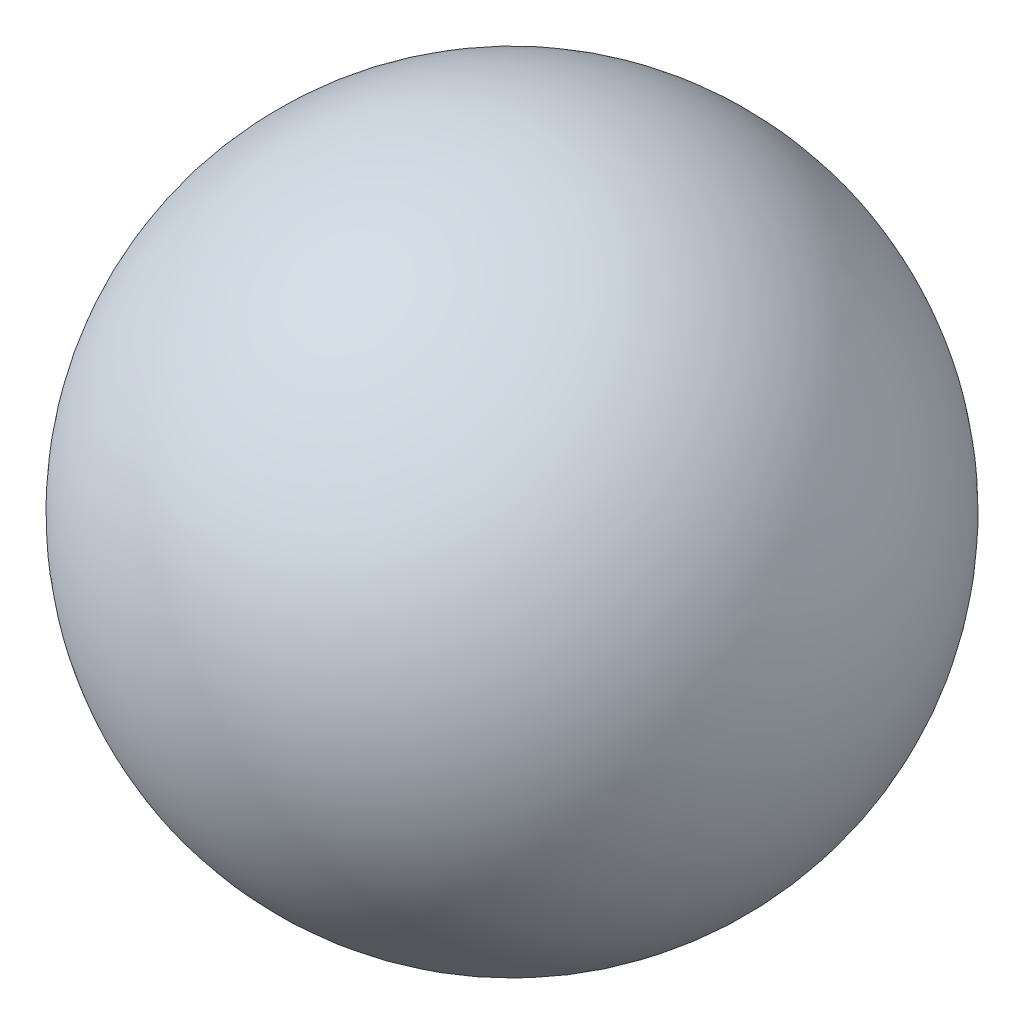
ISO-10303-21;
HEADER;
FILE_DESCRIPTION(('STEP AP214'),'2;1');
FILE_NAME('part.step','',(''),(''),'','','');
FILE_SCHEMA(('AUTOMOTIVE_DESIGN { 1 0 10303 214 1 1 1 1 }'));
ENDSEC;
DATA;
#1=APPLICATION_CONTEXT('core data for automotive mechanical design processes');
#2=APPLICATION_PROTOCOL_DEFINITION('international standard','automotive_design',2000,#1);
#3=PRODUCT_CONTEXT('',#1,'mechanical');
#4=PRODUCT('Part','Part','',(#3));
#5=PRODUCT_RELATED_PRODUCT_CATEGORY('part','',(#4));
#6=PRODUCT_DEFINITION_FORMATION('','',#4);
#7=PRODUCT_DEFINITION_CONTEXT('part definition',#1,'design');
#8=PRODUCT_DEFINITION('design','',#6,#7);
#9=PRODUCT_DEFINITION_SHAPE('','',#8);
#10=(LENGTH_UNIT() NAMED_UNIT(*) SI_UNIT(.MILLI.,.METRE.));
#11=(NAMED_UNIT(*) PLANE_ANGLE_UNIT() SI_UNIT($,.RADIAN.));
#12=(NAMED_UNIT(*) SI_UNIT($,.STERADIAN.) SOLID_ANGLE_UNIT());
#13=UNCERTAINTY_MEASURE_WITH_UNIT(LENGTH_MEASURE(1.E-05),#10,'distance_accuracy_value','');
#14=(GEOMETRIC_REPRESENTATION_CONTEXT(3) GLOBAL_UNCERTAINTY_ASSIGNED_CONTEXT((#13)) GLOBAL_UNIT_ASSIGNED_CONTEXT((#10,
#11,#12)) REPRESENTATION_CONTEXT('',''));
#15=CARTESIAN_POINT('',(0.,0.,0.));
#16=DIRECTION('',(0.,0.,1.));
#17=DIRECTION('',(1.,0.,0.));
#18=AXIS2_PLACEMENT_3D('',#15,#16,#17);
#19=CARTESIAN_POINT('',(-11.1037596198974,-2.,-3.8430485689797));
#20=DIRECTION('',(0.,0.,1.));
#21=DIRECTION('',(1.,0.,0.));
#22=AXIS2_PLACEMENT_3D('',#19,#20,#21);
#23=SPHERICAL_SURFACE('',#22,1.05);
#24=CARTESIAN_POINT('',(-11.1037596198974,-2.,-2.7930485689797));
#25=VERTEX_POINT('',#24);
#26=VERTEX_LOOP('',#25);
#27=FACE_BOUND('',#26,.T.);
#28=ADVANCED_FACE('F13',(#27),#23,.T.);
#29=CLOSED_SHELL('',(#28));
#30=MANIFOLD_SOLID_BREP('B1',#29);
#31=ADVANCED_BREP_SHAPE_REPRESENTATION('',(#18,#30),#14);
#32=SHAPE_DEFINITION_REPRESENTATION(#9,#31);
ENDSEC;
END-ISO-10303-21;
